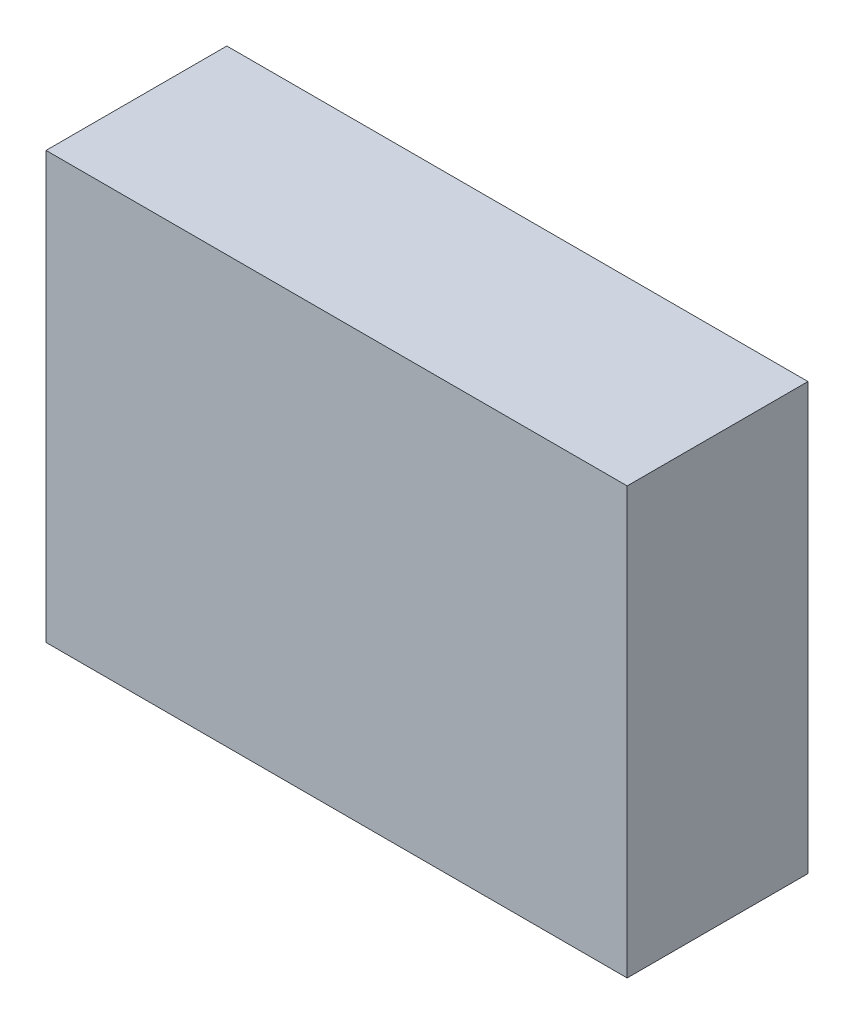
ISO-10303-21;
HEADER;
FILE_DESCRIPTION(('STEP AP214'),'2;1');
FILE_NAME('part.step','',(''),(''),'','','');
FILE_SCHEMA(('AUTOMOTIVE_DESIGN { 1 0 10303 214 1 1 1 1 }'));
ENDSEC;
DATA;
#1=APPLICATION_CONTEXT('core data for automotive mechanical design processes');
#2=APPLICATION_PROTOCOL_DEFINITION('international standard','automotive_design',2000,#1);
#3=PRODUCT_CONTEXT('',#1,'mechanical');
#4=PRODUCT('Part','Part','',(#3));
#5=PRODUCT_RELATED_PRODUCT_CATEGORY('part','',(#4));
#6=PRODUCT_DEFINITION_FORMATION('','',#4);
#7=PRODUCT_DEFINITION_CONTEXT('part definition',#1,'design');
#8=PRODUCT_DEFINITION('design','',#6,#7);
#9=PRODUCT_DEFINITION_SHAPE('','',#8);
#10=(LENGTH_UNIT() NAMED_UNIT(*) SI_UNIT(.MILLI.,.METRE.));
#11=(NAMED_UNIT(*) PLANE_ANGLE_UNIT() SI_UNIT($,.RADIAN.));
#12=(NAMED_UNIT(*) SI_UNIT($,.STERADIAN.) SOLID_ANGLE_UNIT());
#13=UNCERTAINTY_MEASURE_WITH_UNIT(LENGTH_MEASURE(1.E-05),#10,'distance_accuracy_value','');
#14=(GEOMETRIC_REPRESENTATION_CONTEXT(3) GLOBAL_UNCERTAINTY_ASSIGNED_CONTEXT((#13)) GLOBAL_UNIT_ASSIGNED_CONTEXT((#10,
#11,#12)) REPRESENTATION_CONTEXT('',''));
#15=CARTESIAN_POINT('',(0.,0.,0.));
#16=DIRECTION('',(0.,0.,1.));
#17=DIRECTION('',(1.,0.,0.));
#18=AXIS2_PLACEMENT_3D('',#15,#16,#17);
#19=CARTESIAN_POINT('',(-1.12500302191877,-0.825011071186395,-2.84112203121185));
#20=DIRECTION('',(-1.19248806385031E-08,-1.,0.));
#21=DIRECTION('',(1.,-1.19248806385031E-08,0.));
#22=AXIS2_PLACEMENT_3D('',#19,#20,#21);
#23=PLANE('',#22);
#24=DIRECTION('',(1.,-1.19248806617713E-08,0.));
#25=VECTOR('',#24,1.);
#26=CARTESIAN_POINT('',(-1.12500302191877,-0.825011071186395,-2.84112203121185));
#27=LINE('',#26,#25);
#28=CARTESIAN_POINT('',(-1.12500302191877,-0.825011071186395,-2.84112203121185));
#29=VERTEX_POINT('',#28);
#30=CARTESIAN_POINT('',(1.1249893486867,-0.825011098017285,-2.84112203121185));
#31=VERTEX_POINT('',#30);
#32=EDGE_CURVE('E11',#29,#31,#27,.T.);
#33=ORIENTED_EDGE('',*,*,#32,.T.);
#34=DIRECTION('',(0.,0.,1.));
#35=VECTOR('',#34,1.);
#36=CARTESIAN_POINT('',(1.1249893486867,-0.825011098017286,-2.84112203121185));
#37=LINE('',#36,#35);
#38=CARTESIAN_POINT('',(1.1249893486867,-0.825011098017285,-2.14112091064453));
#39=VERTEX_POINT('',#38);
#40=EDGE_CURVE('E88',#31,#39,#37,.T.);
#41=ORIENTED_EDGE('',*,*,#40,.T.);
#42=DIRECTION('',(1.,-1.19248806617713E-08,0.));
#43=VECTOR('',#42,1.);
#44=CARTESIAN_POINT('',(-1.12500302191877,-0.825011071186395,-2.14112091064453));
#45=LINE('',#44,#43);
#46=CARTESIAN_POINT('',(-1.12500302191877,-0.825011071186395,-2.14112091064453));
#47=VERTEX_POINT('',#46);
#48=EDGE_CURVE('E83',#47,#39,#45,.T.);
#49=ORIENTED_EDGE('',*,*,#48,.F.);
#50=DIRECTION('',(0.,0.,1.));
#51=VECTOR('',#50,1.);
#52=CARTESIAN_POINT('',(-1.12500302191877,-0.825011071186395,-2.84112203121185));
#53=LINE('',#52,#51);
#54=EDGE_CURVE('E72',#29,#47,#53,.T.);
#55=ORIENTED_EDGE('',*,*,#54,.F.);
#56=EDGE_LOOP('',(#33,#41,#49,#55));
#57=FACE_BOUND('',#56,.T.);
#58=ADVANCED_FACE('F17',(#57),#23,.T.);
#59=CARTESIAN_POINT('',(1.1249893486867,-0.825011098017285,-2.84112203121185));
#60=DIRECTION('',(1.,-1.19248806385031E-08,0.));
#61=DIRECTION('',(1.19248806385031E-08,1.,0.));
#62=AXIS2_PLACEMENT_3D('',#59,#60,#61);
#63=PLANE('',#62);
#64=DIRECTION('',(1.19248805831428E-08,1.,0.));
#65=VECTOR('',#64,1.);
#66=CARTESIAN_POINT('',(1.1249893486867,-0.825011098017285,-2.84112203121185));
#67=LINE('',#66,#65);
#68=CARTESIAN_POINT('',(1.12498936836268,0.82498279846709,-2.84112203121185));
#69=VERTEX_POINT('',#68);
#70=EDGE_CURVE('E24',#31,#69,#67,.T.);
#71=ORIENTED_EDGE('',*,*,#70,.T.);
#72=DIRECTION('',(0.,0.,1.));
#73=VECTOR('',#72,1.);
#74=CARTESIAN_POINT('',(1.12498936836268,0.82498279846709,-2.84112203121185));
#75=LINE('',#74,#73);
#76=CARTESIAN_POINT('',(1.12498936836268,0.82498279846709,-2.14112091064453));
#77=VERTEX_POINT('',#76);
#78=EDGE_CURVE('E85',#69,#77,#75,.T.);
#79=ORIENTED_EDGE('',*,*,#78,.T.);
#80=DIRECTION('',(1.19248805831428E-08,1.,0.));
#81=VECTOR('',#80,1.);
#82=CARTESIAN_POINT('',(1.1249893486867,-0.825011098017285,-2.14112091064453));
#83=LINE('',#82,#81);
#84=EDGE_CURVE('E66',#39,#77,#83,.T.);
#85=ORIENTED_EDGE('',*,*,#84,.F.);
#86=ORIENTED_EDGE('',*,*,#40,.F.);
#87=EDGE_LOOP('',(#71,#79,#85,#86));
#88=FACE_BOUND('',#87,.T.);
#89=ADVANCED_FACE('F89',(#88),#63,.T.);
#90=CARTESIAN_POINT('',(1.12498936836268,0.82498279846709,-2.84112203121185));
#91=DIRECTION('',(1.19248806385031E-08,1.,0.));
#92=DIRECTION('',(-1.,1.19248806385031E-08,0.));
#93=AXIS2_PLACEMENT_3D('',#90,#91,#92);
#94=PLANE('',#93);
#95=DIRECTION('',(-1.,1.19248806617713E-08,0.));
#96=VECTOR('',#95,1.);
#97=CARTESIAN_POINT('',(1.12498936836268,0.82498279846709,-2.84112203121185));
#98=LINE('',#97,#96);
#99=CARTESIAN_POINT('',(-1.12500300224279,0.82498282529798,-2.84112203121185));
#100=VERTEX_POINT('',#99);
#101=EDGE_CURVE('E62',#69,#100,#98,.T.);
#102=ORIENTED_EDGE('',*,*,#101,.T.);
#103=DIRECTION('',(0.,0.,1.));
#104=VECTOR('',#103,1.);
#105=CARTESIAN_POINT('',(-1.12500300224279,0.824982825297981,-2.84112203121185));
#106=LINE('',#105,#104);
#107=CARTESIAN_POINT('',(-1.12500300224279,0.82498282529798,-2.14112091064453));
#108=VERTEX_POINT('',#107);
#109=EDGE_CURVE('E55',#100,#108,#106,.T.);
#110=ORIENTED_EDGE('',*,*,#109,.T.);
#111=DIRECTION('',(-1.,1.19248806617713E-08,0.));
#112=VECTOR('',#111,1.);
#113=CARTESIAN_POINT('',(1.12498936836268,0.82498279846709,-2.14112091064453));
#114=LINE('',#113,#112);
#115=EDGE_CURVE('E59',#77,#108,#114,.T.);
#116=ORIENTED_EDGE('',*,*,#115,.F.);
#117=ORIENTED_EDGE('',*,*,#78,.F.);
#118=EDGE_LOOP('',(#102,#110,#116,#117));
#119=FACE_BOUND('',#118,.T.);
#120=ADVANCED_FACE('F57',(#119),#94,.T.);
#121=CARTESIAN_POINT('',(-1.12500300224279,0.82498282529798,-2.84112203121185));
#122=DIRECTION('',(-1.,1.19248806385031E-08,0.));
#123=DIRECTION('',(-1.19248806385031E-08,-1.,0.));
#124=AXIS2_PLACEMENT_3D('',#121,#122,#123);
#125=PLANE('',#124);
#126=DIRECTION('',(-1.19248805831428E-08,-1.,0.));
#127=VECTOR('',#126,1.);
#128=CARTESIAN_POINT('',(-1.12500300224279,0.82498282529798,-2.84112203121185));
#129=LINE('',#128,#127);
#130=EDGE_CURVE('E65',#100,#29,#129,.T.);
#131=ORIENTED_EDGE('',*,*,#130,.T.);
#132=ORIENTED_EDGE('',*,*,#54,.T.);
#133=DIRECTION('',(-1.19248805831428E-08,-1.,0.));
#134=VECTOR('',#133,1.);
#135=CARTESIAN_POINT('',(-1.12500300224279,0.82498282529798,-2.14112091064453));
#136=LINE('',#135,#134);
#137=EDGE_CURVE('E70',#108,#47,#136,.T.);
#138=ORIENTED_EDGE('',*,*,#137,.F.);
#139=ORIENTED_EDGE('',*,*,#109,.F.);
#140=EDGE_LOOP('',(#131,#132,#138,#139));
#141=FACE_BOUND('',#140,.T.);
#142=ADVANCED_FACE('F71',(#141),#125,.T.);
#143=CARTESIAN_POINT('',(94.1249923706055,-387.200012207031,-2.14112091064453));
#144=DIRECTION('',(0.,0.,1.));
#145=DIRECTION('',(1.19248806385031E-08,1.,0.));
#146=AXIS2_PLACEMENT_3D('',#143,#144,#145);
#147=PLANE('',#146);
#148=ORIENTED_EDGE('',*,*,#48,.T.);
#149=ORIENTED_EDGE('',*,*,#84,.T.);
#150=ORIENTED_EDGE('',*,*,#115,.T.);
#151=ORIENTED_EDGE('',*,*,#137,.T.);
#152=EDGE_LOOP('',(#148,#149,#150,#151));
#153=FACE_BOUND('',#152,.T.);
#154=ADVANCED_FACE('F76',(#153),#147,.T.);
#155=CARTESIAN_POINT('',(94.1249923706055,-387.200012207031,-2.84112203121185));
#156=DIRECTION('',(0.,0.,1.));
#157=DIRECTION('',(1.19248806385031E-08,1.,0.));
#158=AXIS2_PLACEMENT_3D('',#155,#156,#157);
#159=PLANE('',#158);
#160=ORIENTED_EDGE('',*,*,#130,.F.);
#161=ORIENTED_EDGE('',*,*,#101,.F.);
#162=ORIENTED_EDGE('',*,*,#70,.F.);
#163=ORIENTED_EDGE('',*,*,#32,.F.);
#164=EDGE_LOOP('',(#160,#161,#162,#163));
#165=FACE_BOUND('',#164,.T.);
#166=ADVANCED_FACE('F91',(#165),#159,.F.);
#167=CLOSED_SHELL('',(#58,#89,#120,#142,#154,#166));
#168=MANIFOLD_SOLID_BREP('B1',#167);
#169=ADVANCED_BREP_SHAPE_REPRESENTATION('',(#18,#168),#14);
#170=SHAPE_DEFINITION_REPRESENTATION(#9,#169);
ENDSEC;
END-ISO-10303-21;
